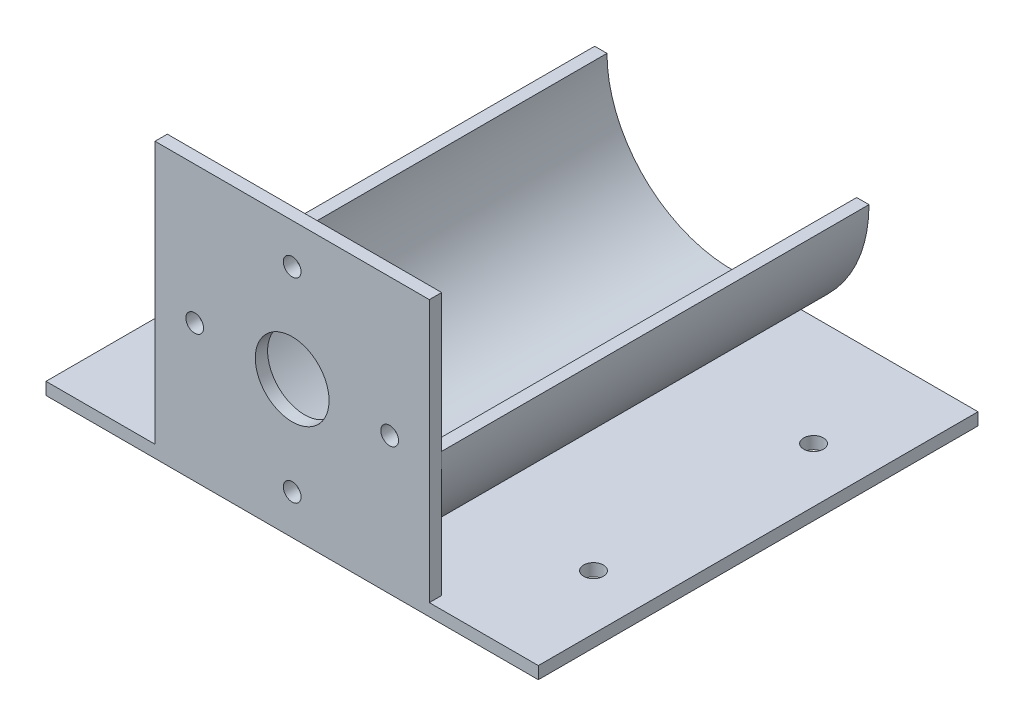
ISO-10303-21;
HEADER;
FILE_DESCRIPTION(('STEP AP214'),'2;1');
FILE_NAME('part.step','',(''),(''),'','','');
FILE_SCHEMA(('AUTOMOTIVE_DESIGN { 1 0 10303 214 1 1 1 1 }'));
ENDSEC;
DATA;
#1=APPLICATION_CONTEXT('core data for automotive mechanical design processes');
#2=APPLICATION_PROTOCOL_DEFINITION('international standard','automotive_design',2000,#1);
#3=PRODUCT_CONTEXT('',#1,'mechanical');
#4=PRODUCT('Part','Part','',(#3));
#5=PRODUCT_RELATED_PRODUCT_CATEGORY('part','',(#4));
#6=PRODUCT_DEFINITION_FORMATION('','',#4);
#7=PRODUCT_DEFINITION_CONTEXT('part definition',#1,'design');
#8=PRODUCT_DEFINITION('design','',#6,#7);
#9=PRODUCT_DEFINITION_SHAPE('','',#8);
#10=(LENGTH_UNIT() NAMED_UNIT(*) SI_UNIT(.MILLI.,.METRE.));
#11=(NAMED_UNIT(*) PLANE_ANGLE_UNIT() SI_UNIT($,.RADIAN.));
#12=(NAMED_UNIT(*) SI_UNIT($,.STERADIAN.) SOLID_ANGLE_UNIT());
#13=UNCERTAINTY_MEASURE_WITH_UNIT(LENGTH_MEASURE(1.E-05),#10,'distance_accuracy_value','');
#14=(GEOMETRIC_REPRESENTATION_CONTEXT(3) GLOBAL_UNCERTAINTY_ASSIGNED_CONTEXT((#13)) GLOBAL_UNIT_ASSIGNED_CONTEXT((#10,
#11,#12)) REPRESENTATION_CONTEXT('',''));
#15=CARTESIAN_POINT('',(0.,0.,0.));
#16=DIRECTION('',(0.,0.,1.));
#17=DIRECTION('',(1.,0.,0.));
#18=AXIS2_PLACEMENT_3D('',#15,#16,#17);
#19=CARTESIAN_POINT('',(0.,-35.3822,110.236));
#20=DIRECTION('',(0.,1.,0.));
#21=DIRECTION('',(0.,0.,1.));
#22=AXIS2_PLACEMENT_3D('',#19,#20,#21);
#23=PLANE('',#22);
#24=CARTESIAN_POINT('',(49.403,-35.3822,28.321));
#25=DIRECTION('',(0.,1.,0.));
#26=DIRECTION('',(0.,0.,-1.));
#27=AXIS2_PLACEMENT_3D('',#24,#25,#26);
#28=CIRCLE('',#27,2.54);
#29=CARTESIAN_POINT('',(49.403,-35.3822,25.781));
#30=VERTEX_POINT('',#29);
#31=EDGE_CURVE('E381',#30,#30,#28,.T.);
#32=ORIENTED_EDGE('',*,*,#31,.T.);
#33=EDGE_LOOP('',(#32));
#34=FACE_BOUND('',#33,.T.);
#35=CARTESIAN_POINT('',(-49.403,-35.3822,85.09));
#36=DIRECTION('',(0.,1.,0.));
#37=DIRECTION('',(0.,0.,-1.));
#38=AXIS2_PLACEMENT_3D('',#35,#36,#37);
#39=CIRCLE('',#38,2.54);
#40=CARTESIAN_POINT('',(-49.403,-35.3822,82.55));
#41=VERTEX_POINT('',#40);
#42=EDGE_CURVE('E389',#41,#41,#39,.T.);
#43=ORIENTED_EDGE('',*,*,#42,.T.);
#44=EDGE_LOOP('',(#43));
#45=FACE_BOUND('',#44,.T.);
#46=CARTESIAN_POINT('',(-49.403,-35.3822,28.321));
#47=DIRECTION('',(0.,1.,0.));
#48=DIRECTION('',(0.,0.,1.));
#49=AXIS2_PLACEMENT_3D('',#46,#47,#48);
#50=CIRCLE('',#49,2.54);
#51=CARTESIAN_POINT('',(-49.403,-35.3822,30.861));
#52=VERTEX_POINT('',#51);
#53=EDGE_CURVE('E390',#52,#52,#50,.T.);
#54=ORIENTED_EDGE('',*,*,#53,.T.);
#55=EDGE_LOOP('',(#54));
#56=FACE_BOUND('',#55,.T.);
#57=CARTESIAN_POINT('',(49.403,-35.3822,85.09));
#58=DIRECTION('',(0.,1.,0.));
#59=DIRECTION('',(0.,0.,1.));
#60=AXIS2_PLACEMENT_3D('',#57,#58,#59);
#61=CIRCLE('',#60,2.54);
#62=CARTESIAN_POINT('',(49.403,-35.3822,87.63));
#63=VERTEX_POINT('',#62);
#64=EDGE_CURVE('E373',#63,#63,#61,.T.);
#65=ORIENTED_EDGE('',*,*,#64,.T.);
#66=EDGE_LOOP('',(#65));
#67=FACE_BOUND('',#66,.T.);
#68=DIRECTION('',(1.,0.,0.));
#69=VECTOR('',#68,1.);
#70=CARTESIAN_POINT('',(0.,-35.3822,0.));
#71=LINE('',#70,#69);
#72=CARTESIAN_POINT('',(-63.5,-35.3822,0.));
#73=VERTEX_POINT('',#72);
#74=CARTESIAN_POINT('',(63.5,-35.3822,0.));
#75=VERTEX_POINT('',#74);
#76=EDGE_CURVE('E244',#73,#75,#71,.T.);
#77=ORIENTED_EDGE('',*,*,#76,.T.);
#78=DIRECTION('',(0.,0.,-1.));
#79=VECTOR('',#78,1.);
#80=CARTESIAN_POINT('',(63.5,-35.3822,110.236));
#81=LINE('',#80,#79);
#82=CARTESIAN_POINT('',(63.5,-35.3822,113.411));
#83=VERTEX_POINT('',#82);
#84=EDGE_CURVE('E12',#83,#75,#81,.T.);
#85=ORIENTED_EDGE('',*,*,#84,.F.);
#86=DIRECTION('',(1.,0.,0.));
#87=VECTOR('',#86,1.);
#88=CARTESIAN_POINT('',(-35.3822,-35.3822,113.411));
#89=LINE('',#88,#87);
#90=CARTESIAN_POINT('',(-63.5,-35.3822,113.411));
#91=VERTEX_POINT('',#90);
#92=EDGE_CURVE('E295',#91,#83,#89,.T.);
#93=ORIENTED_EDGE('',*,*,#92,.F.);
#94=DIRECTION('',(0.,0.,-1.));
#95=VECTOR('',#94,1.);
#96=CARTESIAN_POINT('',(-63.5,-35.3822,110.236));
#97=LINE('',#96,#95);
#98=EDGE_CURVE('E248',#91,#73,#97,.T.);
#99=ORIENTED_EDGE('',*,*,#98,.T.);
#100=EDGE_LOOP('',(#77,#85,#93,#99));
#101=FACE_BOUND('',#100,.T.);
#102=ADVANCED_FACE('F111',(#34,#45,#56,#67,#101),#23,.F.);
#103=CARTESIAN_POINT('',(63.5,0.,110.236));
#104=DIRECTION('',(-1.,0.,0.));
#105=DIRECTION('',(0.,0.,1.));
#106=AXIS2_PLACEMENT_3D('',#103,#104,#105);
#107=PLANE('',#106);
#108=DIRECTION('',(0.,1.,0.));
#109=VECTOR('',#108,1.);
#110=CARTESIAN_POINT('',(63.5,0.,0.));
#111=LINE('',#110,#109);
#112=CARTESIAN_POINT('',(63.5,-32.2072,0.));
#113=VERTEX_POINT('',#112);
#114=EDGE_CURVE('E269',#75,#113,#111,.T.);
#115=ORIENTED_EDGE('',*,*,#114,.T.);
#116=DIRECTION('',(0.,0.,-1.));
#117=VECTOR('',#116,1.);
#118=CARTESIAN_POINT('',(63.5,-32.2072,110.236));
#119=LINE('',#118,#117);
#120=CARTESIAN_POINT('',(63.5,-32.2072,113.411));
#121=VERTEX_POINT('',#120);
#122=EDGE_CURVE('E122',#121,#113,#119,.T.);
#123=ORIENTED_EDGE('',*,*,#122,.F.);
#124=DIRECTION('',(0.,1.,0.));
#125=VECTOR('',#124,1.);
#126=CARTESIAN_POINT('',(63.5,-35.3822,113.411));
#127=LINE('',#126,#125);
#128=EDGE_CURVE('E329',#83,#121,#127,.T.);
#129=ORIENTED_EDGE('',*,*,#128,.F.);
#130=ORIENTED_EDGE('',*,*,#84,.T.);
#131=EDGE_LOOP('',(#115,#123,#129,#130));
#132=FACE_BOUND('',#131,.T.);
#133=ADVANCED_FACE('F449',(#132),#107,.F.);
#134=CARTESIAN_POINT('',(0.,-32.2072,110.236));
#135=DIRECTION('',(0.,1.,0.));
#136=DIRECTION('',(0.,0.,1.));
#137=AXIS2_PLACEMENT_3D('',#134,#135,#136);
#138=PLANE('',#137);
#139=CARTESIAN_POINT('',(49.403,-32.2072,28.321));
#140=DIRECTION('',(0.,1.,0.));
#141=DIRECTION('',(0.,0.,-1.));
#142=AXIS2_PLACEMENT_3D('',#139,#140,#141);
#143=CIRCLE('',#142,2.54);
#144=CARTESIAN_POINT('',(49.403,-32.2072,25.781));
#145=VERTEX_POINT('',#144);
#146=EDGE_CURVE('E394',#145,#145,#143,.T.);
#147=ORIENTED_EDGE('',*,*,#146,.F.);
#148=EDGE_LOOP('',(#147));
#149=FACE_BOUND('',#148,.T.);
#150=CARTESIAN_POINT('',(49.403,-32.2072,85.09));
#151=DIRECTION('',(0.,1.,0.));
#152=DIRECTION('',(0.,0.,1.));
#153=AXIS2_PLACEMENT_3D('',#150,#151,#152);
#154=CIRCLE('',#153,2.54);
#155=CARTESIAN_POINT('',(49.403,-32.2072,87.63));
#156=VERTEX_POINT('',#155);
#157=EDGE_CURVE('E377',#156,#156,#154,.T.);
#158=ORIENTED_EDGE('',*,*,#157,.F.);
#159=EDGE_LOOP('',(#158));
#160=FACE_BOUND('',#159,.T.);
#161=DIRECTION('',(1.,0.,0.));
#162=VECTOR('',#161,1.);
#163=CARTESIAN_POINT('',(0.,-32.2072,0.));
#164=LINE('',#163,#162);
#165=CARTESIAN_POINT('',(14.6491073106862,-32.2072,0.));
#166=VERTEX_POINT('',#165);
#167=EDGE_CURVE('E265',#166,#113,#164,.T.);
#168=ORIENTED_EDGE('',*,*,#167,.F.);
#169=DIRECTION('',(0.,0.,-1.));
#170=VECTOR('',#169,1.);
#171=CARTESIAN_POINT('',(14.6491073106862,-32.2072,110.236));
#172=LINE('',#171,#170);
#173=CARTESIAN_POINT('',(14.6491073106862,-32.2072,110.236));
#174=VERTEX_POINT('',#173);
#175=EDGE_CURVE('E131',#174,#166,#172,.T.);
#176=ORIENTED_EDGE('',*,*,#175,.F.);
#177=DIRECTION('',(1.,0.,0.));
#178=VECTOR('',#177,1.);
#179=CARTESIAN_POINT('',(0.,-32.2072,110.236));
#180=LINE('',#179,#178);
#181=CARTESIAN_POINT('',(35.3822,-32.2072,110.236));
#182=VERTEX_POINT('',#181);
#183=EDGE_CURVE('E264',#174,#182,#180,.T.);
#184=ORIENTED_EDGE('',*,*,#183,.T.);
#185=DIRECTION('',(0.,0.,-1.));
#186=VECTOR('',#185,1.);
#187=CARTESIAN_POINT('',(35.3822,-32.2072,113.411));
#188=LINE('',#187,#186);
#189=CARTESIAN_POINT('',(35.3822,-32.2072,113.411));
#190=VERTEX_POINT('',#189);
#191=EDGE_CURVE('E194',#190,#182,#188,.T.);
#192=ORIENTED_EDGE('',*,*,#191,.F.);
#193=DIRECTION('',(-1.,0.,0.));
#194=VECTOR('',#193,1.);
#195=CARTESIAN_POINT('',(63.5,-32.2072,113.411));
#196=LINE('',#195,#194);
#197=EDGE_CURVE('E325',#121,#190,#196,.T.);
#198=ORIENTED_EDGE('',*,*,#197,.F.);
#199=ORIENTED_EDGE('',*,*,#122,.T.);
#200=EDGE_LOOP('',(#168,#176,#184,#192,#198,#199));
#201=FACE_BOUND('',#200,.T.);
#202=ADVANCED_FACE('F453',(#149,#160,#201),#138,.T.);
#203=CARTESIAN_POINT('',(0.,0.,0.));
#204=DIRECTION('',(0.,0.,1.));
#205=DIRECTION('',(1.,0.,0.));
#206=AXIS2_PLACEMENT_3D('',#203,#204,#205);
#207=PLANE('',#206);
#208=ORIENTED_EDGE('',*,*,#76,.F.);
#209=DIRECTION('',(0.,1.,0.));
#210=VECTOR('',#209,1.);
#211=CARTESIAN_POINT('',(-63.5,0.,0.));
#212=LINE('',#211,#210);
#213=CARTESIAN_POINT('',(-63.5,-32.2072,0.));
#214=VERTEX_POINT('',#213);
#215=EDGE_CURVE('E253',#73,#214,#212,.T.);
#216=ORIENTED_EDGE('',*,*,#215,.T.);
#217=DIRECTION('',(1.,0.,0.));
#218=VECTOR('',#217,1.);
#219=CARTESIAN_POINT('',(0.,-32.2072,0.));
#220=LINE('',#219,#218);
#221=CARTESIAN_POINT('',(-14.6491073106862,-32.2072,0.));
#222=VERTEX_POINT('',#221);
#223=EDGE_CURVE('E177',#214,#222,#220,.T.);
#224=ORIENTED_EDGE('',*,*,#223,.T.);
#225=CARTESIAN_POINT('',(0.,0.,0.));
#226=DIRECTION('',(0.,0.,1.));
#227=DIRECTION('',(1.,0.,0.));
#228=AXIS2_PLACEMENT_3D('',#225,#226,#227);
#229=CIRCLE('',#228,35.3822);
#230=CARTESIAN_POINT('',(-35.3822,0.,0.));
#231=VERTEX_POINT('',#230);
#232=EDGE_CURVE('E169',#231,#222,#229,.T.);
#233=ORIENTED_EDGE('',*,*,#232,.F.);
#234=DIRECTION('',(1.,0.,0.));
#235=VECTOR('',#234,1.);
#236=CARTESIAN_POINT('',(-35.3822,0.,0.));
#237=LINE('',#236,#235);
#238=CARTESIAN_POINT('',(-32.2072,0.,0.));
#239=VERTEX_POINT('',#238);
#240=EDGE_CURVE('E184',#231,#239,#237,.T.);
#241=ORIENTED_EDGE('',*,*,#240,.T.);
#242=CARTESIAN_POINT('',(0.,0.,0.));
#243=DIRECTION('',(0.,0.,1.));
#244=DIRECTION('',(1.,0.,0.));
#245=AXIS2_PLACEMENT_3D('',#242,#243,#244);
#246=CIRCLE('',#245,32.2072);
#247=CARTESIAN_POINT('',(32.2072,0.,0.));
#248=VERTEX_POINT('',#247);
#249=EDGE_CURVE('E193',#239,#248,#246,.T.);
#250=ORIENTED_EDGE('',*,*,#249,.T.);
#251=DIRECTION('',(1.,0.,0.));
#252=VECTOR('',#251,1.);
#253=CARTESIAN_POINT('',(32.2072,0.,0.));
#254=LINE('',#253,#252);
#255=CARTESIAN_POINT('',(35.3822,0.,0.));
#256=VERTEX_POINT('',#255);
#257=EDGE_CURVE('E198',#248,#256,#254,.T.);
#258=ORIENTED_EDGE('',*,*,#257,.T.);
#259=EDGE_CURVE('E158',#166,#256,#229,.T.);
#260=ORIENTED_EDGE('',*,*,#259,.F.);
#261=ORIENTED_EDGE('',*,*,#167,.T.);
#262=ORIENTED_EDGE('',*,*,#114,.F.);
#263=EDGE_LOOP('',(#208,#216,#224,#233,#241,#250,#258,#260,#261,#262));
#264=FACE_BOUND('',#263,.T.);
#265=ADVANCED_FACE('F182',(#264),#207,.F.);
#266=CARTESIAN_POINT('',(0.,-32.2072,110.236));
#267=DIRECTION('',(0.,1.,0.));
#268=DIRECTION('',(0.,0.,1.));
#269=AXIS2_PLACEMENT_3D('',#266,#267,#268);
#270=PLANE('',#269);
#271=CARTESIAN_POINT('',(-49.403,-32.2072,85.09));
#272=DIRECTION('',(0.,1.,0.));
#273=DIRECTION('',(0.,0.,-1.));
#274=AXIS2_PLACEMENT_3D('',#271,#272,#273);
#275=CIRCLE('',#274,2.54);
#276=CARTESIAN_POINT('',(-49.403,-32.2072,82.55));
#277=VERTEX_POINT('',#276);
#278=EDGE_CURVE('E385',#277,#277,#275,.T.);
#279=ORIENTED_EDGE('',*,*,#278,.F.);
#280=EDGE_LOOP('',(#279));
#281=FACE_BOUND('',#280,.T.);
#282=CARTESIAN_POINT('',(-49.403,-32.2072,28.321));
#283=DIRECTION('',(0.,1.,0.));
#284=DIRECTION('',(0.,0.,1.));
#285=AXIS2_PLACEMENT_3D('',#282,#283,#284);
#286=CIRCLE('',#285,2.54);
#287=CARTESIAN_POINT('',(-49.403,-32.2072,30.861));
#288=VERTEX_POINT('',#287);
#289=EDGE_CURVE('E401',#288,#288,#286,.T.);
#290=ORIENTED_EDGE('',*,*,#289,.F.);
#291=EDGE_LOOP('',(#290));
#292=FACE_BOUND('',#291,.T.);
#293=ORIENTED_EDGE('',*,*,#223,.F.);
#294=DIRECTION('',(0.,0.,-1.));
#295=VECTOR('',#294,1.);
#296=CARTESIAN_POINT('',(-63.5,-32.2072,110.236));
#297=LINE('',#296,#295);
#298=CARTESIAN_POINT('',(-63.5,-32.2072,113.411));
#299=VERTEX_POINT('',#298);
#300=EDGE_CURVE('E245',#299,#214,#297,.T.);
#301=ORIENTED_EDGE('',*,*,#300,.F.);
#302=DIRECTION('',(-1.,0.,0.));
#303=VECTOR('',#302,1.);
#304=CARTESIAN_POINT('',(-63.5,-32.2072,113.411));
#305=LINE('',#304,#303);
#306=CARTESIAN_POINT('',(-35.3822,-32.2072,113.411));
#307=VERTEX_POINT('',#306);
#308=EDGE_CURVE('E309',#307,#299,#305,.T.);
#309=ORIENTED_EDGE('',*,*,#308,.F.);
#310=DIRECTION('',(0.,0.,-1.));
#311=VECTOR('',#310,1.);
#312=CARTESIAN_POINT('',(-35.3822,-32.2072,113.411));
#313=LINE('',#312,#311);
#314=CARTESIAN_POINT('',(-35.3822,-32.2072,110.236));
#315=VERTEX_POINT('',#314);
#316=EDGE_CURVE('E286',#307,#315,#313,.T.);
#317=ORIENTED_EDGE('',*,*,#316,.T.);
#318=DIRECTION('',(1.,0.,0.));
#319=VECTOR('',#318,1.);
#320=CARTESIAN_POINT('',(0.,-32.2072,110.236));
#321=LINE('',#320,#319);
#322=CARTESIAN_POINT('',(-14.6491073106862,-32.2072,110.236));
#323=VERTEX_POINT('',#322);
#324=EDGE_CURVE('E252',#315,#323,#321,.T.);
#325=ORIENTED_EDGE('',*,*,#324,.T.);
#326=DIRECTION('',(0.,0.,-1.));
#327=VECTOR('',#326,1.);
#328=CARTESIAN_POINT('',(-14.6491073106862,-32.2072,110.236));
#329=LINE('',#328,#327);
#330=EDGE_CURVE('E241',#323,#222,#329,.T.);
#331=ORIENTED_EDGE('',*,*,#330,.T.);
#332=EDGE_LOOP('',(#293,#301,#309,#317,#325,#331));
#333=FACE_BOUND('',#332,.T.);
#334=ADVANCED_FACE('F419',(#281,#292,#333),#270,.T.);
#335=CARTESIAN_POINT('',(-63.5,0.,110.236));
#336=DIRECTION('',(-1.,0.,0.));
#337=DIRECTION('',(0.,0.,1.));
#338=AXIS2_PLACEMENT_3D('',#335,#336,#337);
#339=PLANE('',#338);
#340=ORIENTED_EDGE('',*,*,#215,.F.);
#341=ORIENTED_EDGE('',*,*,#98,.F.);
#342=DIRECTION('',(0.,-1.,0.));
#343=VECTOR('',#342,1.);
#344=CARTESIAN_POINT('',(-63.5,-35.3822,113.411));
#345=LINE('',#344,#343);
#346=EDGE_CURVE('E290',#299,#91,#345,.T.);
#347=ORIENTED_EDGE('',*,*,#346,.F.);
#348=ORIENTED_EDGE('',*,*,#300,.T.);
#349=EDGE_LOOP('',(#340,#341,#347,#348));
#350=FACE_BOUND('',#349,.T.);
#351=ADVANCED_FACE('F422',(#350),#339,.T.);
#352=CARTESIAN_POINT('',(0.,0.,110.236));
#353=DIRECTION('',(0.,0.,-1.));
#354=DIRECTION('',(-1.,0.,0.));
#355=AXIS2_PLACEMENT_3D('',#352,#353,#354);
#356=CYLINDRICAL_SURFACE('',#355,35.3822);
#357=ORIENTED_EDGE('',*,*,#330,.F.);
#358=CARTESIAN_POINT('',(0.,0.,110.236));
#359=DIRECTION('',(0.,0.,1.));
#360=DIRECTION('',(1.,0.,0.));
#361=AXIS2_PLACEMENT_3D('',#358,#359,#360);
#362=CIRCLE('',#361,35.3822);
#363=CARTESIAN_POINT('',(-35.3822,0.,110.236));
#364=VERTEX_POINT('',#363);
#365=EDGE_CURVE('E172',#364,#323,#362,.T.);
#366=ORIENTED_EDGE('',*,*,#365,.F.);
#367=DIRECTION('',(0.,0.,-1.));
#368=VECTOR('',#367,1.);
#369=CARTESIAN_POINT('',(-35.3822,0.,110.236));
#370=LINE('',#369,#368);
#371=EDGE_CURVE('E165',#364,#231,#370,.T.);
#372=ORIENTED_EDGE('',*,*,#371,.T.);
#373=ORIENTED_EDGE('',*,*,#232,.T.);
#374=EDGE_LOOP('',(#357,#366,#372,#373));
#375=FACE_BOUND('',#374,.T.);
#376=ADVANCED_FACE('F168',(#375),#356,.T.);
#377=ORIENTED_EDGE('',*,*,#175,.T.);
#378=ORIENTED_EDGE('',*,*,#259,.T.);
#379=DIRECTION('',(0.,0.,-1.));
#380=VECTOR('',#379,1.);
#381=CARTESIAN_POINT('',(35.3822,0.,110.236));
#382=LINE('',#381,#380);
#383=CARTESIAN_POINT('',(35.3822,0.,110.236));
#384=VERTEX_POINT('',#383);
#385=EDGE_CURVE('E178',#384,#256,#382,.T.);
#386=ORIENTED_EDGE('',*,*,#385,.F.);
#387=EDGE_CURVE('E218',#174,#384,#362,.T.);
#388=ORIENTED_EDGE('',*,*,#387,.F.);
#389=EDGE_LOOP('',(#377,#378,#386,#388));
#390=FACE_BOUND('',#389,.T.);
#391=ADVANCED_FACE('F493',(#390),#356,.T.);
#392=CARTESIAN_POINT('',(32.2072,0.,110.236));
#393=DIRECTION('',(0.,1.,0.));
#394=DIRECTION('',(0.,0.,1.));
#395=AXIS2_PLACEMENT_3D('',#392,#393,#394);
#396=PLANE('',#395);
#397=ORIENTED_EDGE('',*,*,#257,.F.);
#398=DIRECTION('',(0.,0.,-1.));
#399=VECTOR('',#398,1.);
#400=CARTESIAN_POINT('',(32.2072,0.,110.236));
#401=LINE('',#400,#399);
#402=CARTESIAN_POINT('',(32.2072,0.,110.236));
#403=VERTEX_POINT('',#402);
#404=EDGE_CURVE('E210',#403,#248,#401,.T.);
#405=ORIENTED_EDGE('',*,*,#404,.F.);
#406=DIRECTION('',(1.,0.,0.));
#407=VECTOR('',#406,1.);
#408=CARTESIAN_POINT('',(32.2072,0.,110.236));
#409=LINE('',#408,#407);
#410=EDGE_CURVE('E225',#403,#384,#409,.T.);
#411=ORIENTED_EDGE('',*,*,#410,.T.);
#412=ORIENTED_EDGE('',*,*,#385,.T.);
#413=EDGE_LOOP('',(#397,#405,#411,#412));
#414=FACE_BOUND('',#413,.T.);
#415=ADVANCED_FACE('F494',(#414),#396,.T.);
#416=CARTESIAN_POINT('',(0.,0.,110.236));
#417=DIRECTION('',(0.,0.,-1.));
#418=DIRECTION('',(-1.,0.,0.));
#419=AXIS2_PLACEMENT_3D('',#416,#417,#418);
#420=CYLINDRICAL_SURFACE('',#419,32.2072);
#421=ORIENTED_EDGE('',*,*,#249,.F.);
#422=DIRECTION('',(0.,0.,-1.));
#423=VECTOR('',#422,1.);
#424=CARTESIAN_POINT('',(-32.2072,0.,110.236));
#425=LINE('',#424,#423);
#426=CARTESIAN_POINT('',(-32.2072,0.,110.236));
#427=VERTEX_POINT('',#426);
#428=EDGE_CURVE('E115',#427,#239,#425,.T.);
#429=ORIENTED_EDGE('',*,*,#428,.F.);
#430=CARTESIAN_POINT('',(0.,0.,110.236));
#431=DIRECTION('',(0.,0.,1.));
#432=DIRECTION('',(1.,0.,0.));
#433=AXIS2_PLACEMENT_3D('',#430,#431,#432);
#434=CIRCLE('',#433,32.2072);
#435=EDGE_CURVE('E233',#427,#403,#434,.T.);
#436=ORIENTED_EDGE('',*,*,#435,.T.);
#437=ORIENTED_EDGE('',*,*,#404,.T.);
#438=EDGE_LOOP('',(#421,#429,#436,#437));
#439=FACE_BOUND('',#438,.T.);
#440=ADVANCED_FACE('F495',(#439),#420,.F.);
#441=CARTESIAN_POINT('',(-35.3822,0.,110.236));
#442=DIRECTION('',(0.,1.,0.));
#443=DIRECTION('',(0.,0.,1.));
#444=AXIS2_PLACEMENT_3D('',#441,#442,#443);
#445=PLANE('',#444);
#446=ORIENTED_EDGE('',*,*,#240,.F.);
#447=ORIENTED_EDGE('',*,*,#371,.F.);
#448=DIRECTION('',(1.,0.,0.));
#449=VECTOR('',#448,1.);
#450=CARTESIAN_POINT('',(-35.3822,0.,110.236));
#451=LINE('',#450,#449);
#452=EDGE_CURVE('E188',#364,#427,#451,.T.);
#453=ORIENTED_EDGE('',*,*,#452,.T.);
#454=ORIENTED_EDGE('',*,*,#428,.T.);
#455=EDGE_LOOP('',(#446,#447,#453,#454));
#456=FACE_BOUND('',#455,.T.);
#457=ADVANCED_FACE('F113',(#456),#445,.T.);
#458=CARTESIAN_POINT('',(0.,0.,110.236));
#459=DIRECTION('',(0.,0.,-1.));
#460=DIRECTION('',(-1.,0.,0.));
#461=AXIS2_PLACEMENT_3D('',#458,#459,#460);
#462=PLANE('',#461);
#463=ORIENTED_EDGE('',*,*,#183,.F.);
#464=ORIENTED_EDGE('',*,*,#387,.T.);
#465=DIRECTION('',(0.,1.,0.));
#466=VECTOR('',#465,1.);
#467=CARTESIAN_POINT('',(35.3822,-32.2072,110.236));
#468=LINE('',#467,#466);
#469=EDGE_CURVE('E301',#182,#384,#468,.T.);
#470=ORIENTED_EDGE('',*,*,#469,.F.);
#471=EDGE_LOOP('',(#463,#464,#470));
#472=FACE_BOUND('',#471,.T.);
#473=ADVANCED_FACE('F492',(#472),#462,.T.);
#474=CARTESIAN_POINT('',(25.146,0.,110.236));
#475=DIRECTION('',(0.,0.,1.));
#476=DIRECTION('',(1.,0.,0.));
#477=AXIS2_PLACEMENT_3D('',#474,#475,#476);
#478=CIRCLE('',#477,2.286);
#479=CARTESIAN_POINT('',(27.432,0.,110.236));
#480=VERTEX_POINT('',#479);
#481=EDGE_CURVE('E361',#480,#480,#478,.T.);
#482=ORIENTED_EDGE('',*,*,#481,.T.);
#483=EDGE_LOOP('',(#482));
#484=FACE_BOUND('',#483,.T.);
#485=CARTESIAN_POINT('',(0.,0.,110.236));
#486=DIRECTION('',(0.,0.,1.));
#487=DIRECTION('',(1.,0.,0.));
#488=AXIS2_PLACEMENT_3D('',#485,#486,#487);
#489=CIRCLE('',#488,9.5123);
#490=CARTESIAN_POINT('',(9.5123,0.,110.236));
#491=VERTEX_POINT('',#490);
#492=EDGE_CURVE('E345',#491,#491,#489,.T.);
#493=ORIENTED_EDGE('',*,*,#492,.T.);
#494=EDGE_LOOP('',(#493));
#495=FACE_BOUND('',#494,.T.);
#496=CARTESIAN_POINT('',(-25.146,6.32363889836121E-13,110.236));
#497=DIRECTION('',(0.,0.,1.));
#498=DIRECTION('',(1.,0.,0.));
#499=AXIS2_PLACEMENT_3D('',#496,#497,#498);
#500=CIRCLE('',#499,2.286);
#501=CARTESIAN_POINT('',(-22.86,6.32363889836121E-13,110.236));
#502=VERTEX_POINT('',#501);
#503=EDGE_CURVE('E336',#502,#502,#500,.T.);
#504=ORIENTED_EDGE('',*,*,#503,.T.);
#505=EDGE_LOOP('',(#504));
#506=FACE_BOUND('',#505,.T.);
#507=CARTESIAN_POINT('',(2.77406393454827E-13,25.1460000000004,110.236));
#508=DIRECTION('',(0.,0.,1.));
#509=DIRECTION('',(1.,0.,0.));
#510=AXIS2_PLACEMENT_3D('',#507,#508,#509);
#511=CIRCLE('',#510,2.286);
#512=CARTESIAN_POINT('',(2.28600000000028,25.1460000000004,110.236));
#513=VERTEX_POINT('',#512);
#514=EDGE_CURVE('E353',#513,#513,#511,.T.);
#515=ORIENTED_EDGE('',*,*,#514,.T.);
#516=EDGE_LOOP('',(#515));
#517=FACE_BOUND('',#516,.T.);
#518=CARTESIAN_POINT('',(-2.74326896613691E-13,-25.1459999999996,110.236));
#519=DIRECTION('',(0.,0.,1.));
#520=DIRECTION('',(1.,0.,0.));
#521=AXIS2_PLACEMENT_3D('',#518,#519,#520);
#522=CIRCLE('',#521,2.286);
#523=CARTESIAN_POINT('',(2.28599999999972,-25.1459999999996,110.236));
#524=VERTEX_POINT('',#523);
#525=EDGE_CURVE('E369',#524,#524,#522,.T.);
#526=ORIENTED_EDGE('',*,*,#525,.T.);
#527=EDGE_LOOP('',(#526));
#528=FACE_BOUND('',#527,.T.);
#529=ORIENTED_EDGE('',*,*,#410,.F.);
#530=ORIENTED_EDGE('',*,*,#435,.F.);
#531=ORIENTED_EDGE('',*,*,#452,.F.);
#532=DIRECTION('',(0.,-1.,0.));
#533=VECTOR('',#532,1.);
#534=CARTESIAN_POINT('',(-35.3822,-32.2072,110.236));
#535=LINE('',#534,#533);
#536=CARTESIAN_POINT('',(-35.3822,35.4838,110.236));
#537=VERTEX_POINT('',#536);
#538=EDGE_CURVE('E291',#537,#364,#535,.T.);
#539=ORIENTED_EDGE('',*,*,#538,.F.);
#540=DIRECTION('',(-1.,0.,0.));
#541=VECTOR('',#540,1.);
#542=CARTESIAN_POINT('',(-35.3822,35.4838,110.236));
#543=LINE('',#542,#541);
#544=CARTESIAN_POINT('',(35.3822,35.4838,110.236));
#545=VERTEX_POINT('',#544);
#546=EDGE_CURVE('E297',#545,#537,#543,.T.);
#547=ORIENTED_EDGE('',*,*,#546,.F.);
#548=EDGE_CURVE('E305',#384,#545,#468,.T.);
#549=ORIENTED_EDGE('',*,*,#548,.F.);
#550=EDGE_LOOP('',(#529,#530,#531,#539,#547,#549));
#551=FACE_BOUND('',#550,.T.);
#552=ADVANCED_FACE('F498',(#484,#495,#506,#517,#528,#551),#462,.T.);
#553=CARTESIAN_POINT('',(0.,0.,113.411));
#554=DIRECTION('',(0.,0.,-1.));
#555=DIRECTION('',(-1.,0.,0.));
#556=AXIS2_PLACEMENT_3D('',#553,#554,#555);
#557=PLANE('',#556);
#558=ORIENTED_EDGE('',*,*,#92,.T.);
#559=ORIENTED_EDGE('',*,*,#128,.T.);
#560=ORIENTED_EDGE('',*,*,#197,.T.);
#561=DIRECTION('',(0.,1.,0.));
#562=VECTOR('',#561,1.);
#563=CARTESIAN_POINT('',(35.3822,-32.2072,113.411));
#564=LINE('',#563,#562);
#565=CARTESIAN_POINT('',(35.3822,35.4838,113.411));
#566=VERTEX_POINT('',#565);
#567=EDGE_CURVE('E321',#190,#566,#564,.T.);
#568=ORIENTED_EDGE('',*,*,#567,.T.);
#569=DIRECTION('',(-1.,0.,0.));
#570=VECTOR('',#569,1.);
#571=CARTESIAN_POINT('',(-35.3822,35.4838,113.411));
#572=LINE('',#571,#570);
#573=CARTESIAN_POINT('',(-35.3822,35.4838,113.411));
#574=VERTEX_POINT('',#573);
#575=EDGE_CURVE('E317',#566,#574,#572,.T.);
#576=ORIENTED_EDGE('',*,*,#575,.T.);
#577=DIRECTION('',(0.,-1.,0.));
#578=VECTOR('',#577,1.);
#579=CARTESIAN_POINT('',(-35.3822,-32.2072,113.411));
#580=LINE('',#579,#578);
#581=EDGE_CURVE('E313',#574,#307,#580,.T.);
#582=ORIENTED_EDGE('',*,*,#581,.T.);
#583=ORIENTED_EDGE('',*,*,#308,.T.);
#584=ORIENTED_EDGE('',*,*,#346,.T.);
#585=EDGE_LOOP('',(#558,#559,#560,#568,#576,#582,#583,#584));
#586=FACE_BOUND('',#585,.T.);
#587=CARTESIAN_POINT('',(-25.146,6.32363889836121E-13,113.411));
#588=DIRECTION('',(0.,0.,1.));
#589=DIRECTION('',(1.,0.,0.));
#590=AXIS2_PLACEMENT_3D('',#587,#588,#589);
#591=CIRCLE('',#590,2.286);
#592=CARTESIAN_POINT('',(-22.86,6.32363889836121E-13,113.411));
#593=VERTEX_POINT('',#592);
#594=EDGE_CURVE('E340',#593,#593,#591,.T.);
#595=ORIENTED_EDGE('',*,*,#594,.F.);
#596=EDGE_LOOP('',(#595));
#597=FACE_BOUND('',#596,.T.);
#598=CARTESIAN_POINT('',(0.,0.,113.411));
#599=DIRECTION('',(0.,0.,1.));
#600=DIRECTION('',(1.,0.,0.));
#601=AXIS2_PLACEMENT_3D('',#598,#599,#600);
#602=CIRCLE('',#601,9.5123);
#603=CARTESIAN_POINT('',(9.5123,0.,113.411));
#604=VERTEX_POINT('',#603);
#605=EDGE_CURVE('E341',#604,#604,#602,.T.);
#606=ORIENTED_EDGE('',*,*,#605,.F.);
#607=EDGE_LOOP('',(#606));
#608=FACE_BOUND('',#607,.T.);
#609=CARTESIAN_POINT('',(2.77406393454827E-13,25.1460000000004,113.411));
#610=DIRECTION('',(0.,0.,1.));
#611=DIRECTION('',(1.,0.,0.));
#612=AXIS2_PLACEMENT_3D('',#609,#610,#611);
#613=CIRCLE('',#612,2.286);
#614=CARTESIAN_POINT('',(2.28600000000028,25.1460000000004,113.411));
#615=VERTEX_POINT('',#614);
#616=EDGE_CURVE('E349',#615,#615,#613,.T.);
#617=ORIENTED_EDGE('',*,*,#616,.F.);
#618=EDGE_LOOP('',(#617));
#619=FACE_BOUND('',#618,.T.);
#620=CARTESIAN_POINT('',(25.146,0.,113.411));
#621=DIRECTION('',(0.,0.,1.));
#622=DIRECTION('',(1.,0.,0.));
#623=AXIS2_PLACEMENT_3D('',#620,#621,#622);
#624=CIRCLE('',#623,2.286);
#625=CARTESIAN_POINT('',(27.432,0.,113.411));
#626=VERTEX_POINT('',#625);
#627=EDGE_CURVE('E357',#626,#626,#624,.T.);
#628=ORIENTED_EDGE('',*,*,#627,.F.);
#629=EDGE_LOOP('',(#628));
#630=FACE_BOUND('',#629,.T.);
#631=CARTESIAN_POINT('',(-2.74326896613691E-13,-25.1459999999996,113.411));
#632=DIRECTION('',(0.,0.,1.));
#633=DIRECTION('',(1.,0.,0.));
#634=AXIS2_PLACEMENT_3D('',#631,#632,#633);
#635=CIRCLE('',#634,2.286);
#636=CARTESIAN_POINT('',(2.28599999999972,-25.1459999999996,113.411));
#637=VERTEX_POINT('',#636);
#638=EDGE_CURVE('E365',#637,#637,#635,.T.);
#639=ORIENTED_EDGE('',*,*,#638,.F.);
#640=EDGE_LOOP('',(#639));
#641=FACE_BOUND('',#640,.T.);
#642=ADVANCED_FACE('F438',(#586,#597,#608,#619,#630,#641),#557,.F.);
#643=EDGE_CURVE('E296',#364,#315,#535,.T.);
#644=ORIENTED_EDGE('',*,*,#643,.F.);
#645=ORIENTED_EDGE('',*,*,#365,.T.);
#646=ORIENTED_EDGE('',*,*,#324,.F.);
#647=EDGE_LOOP('',(#644,#645,#646));
#648=FACE_BOUND('',#647,.T.);
#649=ADVANCED_FACE('F500',(#648),#462,.T.);
#650=CARTESIAN_POINT('',(35.3822,-32.2072,113.411));
#651=DIRECTION('',(-1.,0.,0.));
#652=DIRECTION('',(0.,0.,1.));
#653=AXIS2_PLACEMENT_3D('',#650,#651,#652);
#654=PLANE('',#653);
#655=ORIENTED_EDGE('',*,*,#469,.T.);
#656=ORIENTED_EDGE('',*,*,#548,.T.);
#657=DIRECTION('',(0.,0.,-1.));
#658=VECTOR('',#657,1.);
#659=CARTESIAN_POINT('',(35.3822,35.4838,113.411));
#660=LINE('',#659,#658);
#661=EDGE_CURVE('E201',#566,#545,#660,.T.);
#662=ORIENTED_EDGE('',*,*,#661,.F.);
#663=ORIENTED_EDGE('',*,*,#567,.F.);
#664=ORIENTED_EDGE('',*,*,#191,.T.);
#665=EDGE_LOOP('',(#655,#656,#662,#663,#664));
#666=FACE_BOUND('',#665,.T.);
#667=ADVANCED_FACE('F464',(#666),#654,.F.);
#668=CARTESIAN_POINT('',(-35.3822,35.4838,113.411));
#669=DIRECTION('',(0.,-1.,0.));
#670=DIRECTION('',(0.,0.,-1.));
#671=AXIS2_PLACEMENT_3D('',#668,#669,#670);
#672=PLANE('',#671);
#673=ORIENTED_EDGE('',*,*,#546,.T.);
#674=DIRECTION('',(0.,0.,-1.));
#675=VECTOR('',#674,1.);
#676=CARTESIAN_POINT('',(-35.3822,35.4838,113.411));
#677=LINE('',#676,#675);
#678=EDGE_CURVE('E282',#574,#537,#677,.T.);
#679=ORIENTED_EDGE('',*,*,#678,.F.);
#680=ORIENTED_EDGE('',*,*,#575,.F.);
#681=ORIENTED_EDGE('',*,*,#661,.T.);
#682=EDGE_LOOP('',(#673,#679,#680,#681));
#683=FACE_BOUND('',#682,.T.);
#684=ADVANCED_FACE('F473',(#683),#672,.F.);
#685=CARTESIAN_POINT('',(-35.3822,-32.2072,113.411));
#686=DIRECTION('',(1.,0.,0.));
#687=DIRECTION('',(0.,0.,-1.));
#688=AXIS2_PLACEMENT_3D('',#685,#686,#687);
#689=PLANE('',#688);
#690=ORIENTED_EDGE('',*,*,#538,.T.);
#691=ORIENTED_EDGE('',*,*,#643,.T.);
#692=ORIENTED_EDGE('',*,*,#316,.F.);
#693=ORIENTED_EDGE('',*,*,#581,.F.);
#694=ORIENTED_EDGE('',*,*,#678,.T.);
#695=EDGE_LOOP('',(#690,#691,#692,#693,#694));
#696=FACE_BOUND('',#695,.T.);
#697=ADVANCED_FACE('F503',(#696),#689,.F.);
#698=CARTESIAN_POINT('',(-25.146,6.32363889836121E-13,113.411));
#699=DIRECTION('',(0.,0.,-1.));
#700=DIRECTION('',(-1.,0.,0.));
#701=AXIS2_PLACEMENT_3D('',#698,#699,#700);
#702=CYLINDRICAL_SURFACE('',#701,2.286);
#703=ORIENTED_EDGE('',*,*,#594,.T.);
#704=EDGE_LOOP('',(#703));
#705=FACE_BOUND('',#704,.T.);
#706=ORIENTED_EDGE('',*,*,#503,.F.);
#707=EDGE_LOOP('',(#706));
#708=FACE_BOUND('',#707,.T.);
#709=ADVANCED_FACE('F505',(#705,#708),#702,.F.);
#710=CARTESIAN_POINT('',(0.,0.,113.411));
#711=DIRECTION('',(0.,0.,-1.));
#712=DIRECTION('',(-1.,0.,0.));
#713=AXIS2_PLACEMENT_3D('',#710,#711,#712);
#714=CYLINDRICAL_SURFACE('',#713,9.5123);
#715=ORIENTED_EDGE('',*,*,#605,.T.);
#716=EDGE_LOOP('',(#715));
#717=FACE_BOUND('',#716,.T.);
#718=ORIENTED_EDGE('',*,*,#492,.F.);
#719=EDGE_LOOP('',(#718));
#720=FACE_BOUND('',#719,.T.);
#721=ADVANCED_FACE('F511',(#717,#720),#714,.F.);
#722=CARTESIAN_POINT('',(2.77406393454827E-13,25.1460000000004,113.411));
#723=DIRECTION('',(0.,0.,-1.));
#724=DIRECTION('',(-1.,0.,0.));
#725=AXIS2_PLACEMENT_3D('',#722,#723,#724);
#726=CYLINDRICAL_SURFACE('',#725,2.286);
#727=ORIENTED_EDGE('',*,*,#616,.T.);
#728=EDGE_LOOP('',(#727));
#729=FACE_BOUND('',#728,.T.);
#730=ORIENTED_EDGE('',*,*,#514,.F.);
#731=EDGE_LOOP('',(#730));
#732=FACE_BOUND('',#731,.T.);
#733=ADVANCED_FACE('F552',(#729,#732),#726,.F.);
#734=CARTESIAN_POINT('',(25.146,0.,113.411));
#735=DIRECTION('',(0.,0.,-1.));
#736=DIRECTION('',(-1.,0.,0.));
#737=AXIS2_PLACEMENT_3D('',#734,#735,#736);
#738=CYLINDRICAL_SURFACE('',#737,2.286);
#739=ORIENTED_EDGE('',*,*,#627,.T.);
#740=EDGE_LOOP('',(#739));
#741=FACE_BOUND('',#740,.T.);
#742=ORIENTED_EDGE('',*,*,#481,.F.);
#743=EDGE_LOOP('',(#742));
#744=FACE_BOUND('',#743,.T.);
#745=ADVANCED_FACE('F556',(#741,#744),#738,.F.);
#746=CARTESIAN_POINT('',(-2.74326896613691E-13,-25.1459999999996,113.411));
#747=DIRECTION('',(0.,0.,-1.));
#748=DIRECTION('',(-1.,0.,0.));
#749=AXIS2_PLACEMENT_3D('',#746,#747,#748);
#750=CYLINDRICAL_SURFACE('',#749,2.286);
#751=ORIENTED_EDGE('',*,*,#638,.T.);
#752=EDGE_LOOP('',(#751));
#753=FACE_BOUND('',#752,.T.);
#754=ORIENTED_EDGE('',*,*,#525,.F.);
#755=EDGE_LOOP('',(#754));
#756=FACE_BOUND('',#755,.T.);
#757=ADVANCED_FACE('F415',(#753,#756),#750,.F.);
#758=CARTESIAN_POINT('',(-49.403,-35.3822,28.321));
#759=DIRECTION('',(0.,1.,0.));
#760=DIRECTION('',(0.,0.,1.));
#761=AXIS2_PLACEMENT_3D('',#758,#759,#760);
#762=CYLINDRICAL_SURFACE('',#761,2.54);
#763=ORIENTED_EDGE('',*,*,#53,.F.);
#764=EDGE_LOOP('',(#763));
#765=FACE_BOUND('',#764,.T.);
#766=ORIENTED_EDGE('',*,*,#289,.T.);
#767=EDGE_LOOP('',(#766));
#768=FACE_BOUND('',#767,.T.);
#769=ADVANCED_FACE('F411',(#765,#768),#762,.F.);
#770=CARTESIAN_POINT('',(-49.403,-35.3822,85.09));
#771=DIRECTION('',(0.,1.,0.));
#772=DIRECTION('',(0.,0.,1.));
#773=AXIS2_PLACEMENT_3D('',#770,#771,#772);
#774=CYLINDRICAL_SURFACE('',#773,2.54);
#775=ORIENTED_EDGE('',*,*,#42,.F.);
#776=EDGE_LOOP('',(#775));
#777=FACE_BOUND('',#776,.T.);
#778=ORIENTED_EDGE('',*,*,#278,.T.);
#779=EDGE_LOOP('',(#778));
#780=FACE_BOUND('',#779,.T.);
#781=ADVANCED_FACE('F414',(#777,#780),#774,.F.);
#782=CARTESIAN_POINT('',(49.403,-35.3822,85.09));
#783=DIRECTION('',(0.,1.,0.));
#784=DIRECTION('',(0.,0.,1.));
#785=AXIS2_PLACEMENT_3D('',#782,#783,#784);
#786=CYLINDRICAL_SURFACE('',#785,2.54);
#787=ORIENTED_EDGE('',*,*,#64,.F.);
#788=EDGE_LOOP('',(#787));
#789=FACE_BOUND('',#788,.T.);
#790=ORIENTED_EDGE('',*,*,#157,.T.);
#791=EDGE_LOOP('',(#790));
#792=FACE_BOUND('',#791,.T.);
#793=ADVANCED_FACE('F564',(#789,#792),#786,.F.);
#794=CARTESIAN_POINT('',(49.403,-35.3822,28.321));
#795=DIRECTION('',(0.,1.,0.));
#796=DIRECTION('',(0.,0.,1.));
#797=AXIS2_PLACEMENT_3D('',#794,#795,#796);
#798=CYLINDRICAL_SURFACE('',#797,2.54);
#799=ORIENTED_EDGE('',*,*,#31,.F.);
#800=EDGE_LOOP('',(#799));
#801=FACE_BOUND('',#800,.T.);
#802=ORIENTED_EDGE('',*,*,#146,.T.);
#803=EDGE_LOOP('',(#802));
#804=FACE_BOUND('',#803,.T.);
#805=ADVANCED_FACE('F567',(#801,#804),#798,.F.);
#806=CLOSED_SHELL('',(#102,#133,#202,#265,#334,#351,#376,#391,#415,#440,#457,#473,#552,#642,
#649,#667,#684,#697,#709,#721,#733,#745,#757,#769,#781,#793,#805));
#807=MANIFOLD_SOLID_BREP('B2',#806);
#808=ADVANCED_BREP_SHAPE_REPRESENTATION('',(#18,#807),#14);
#809=SHAPE_DEFINITION_REPRESENTATION(#9,#808);
ENDSEC;
END-ISO-10303-21;
